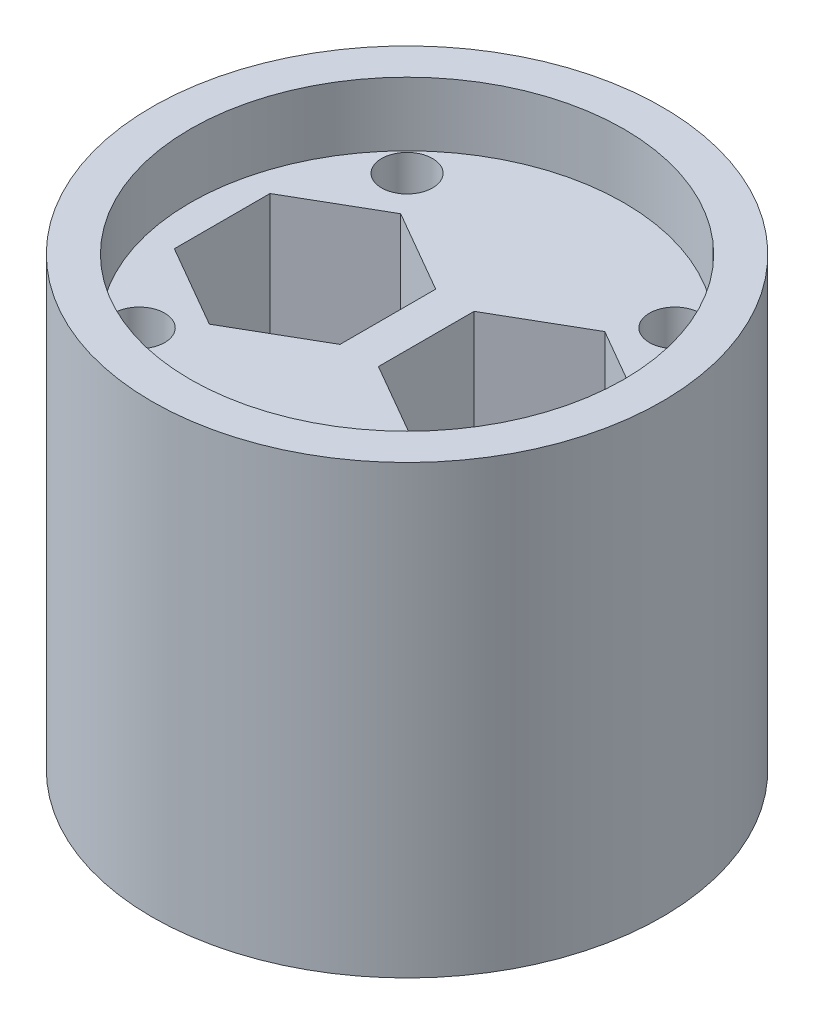
ISO-10303-21;
HEADER;
FILE_DESCRIPTION(('STEP AP214'),'2;1');
FILE_NAME('part.step','',(''),(''),'','','');
FILE_SCHEMA(('AUTOMOTIVE_DESIGN { 1 0 10303 214 1 1 1 1 }'));
ENDSEC;
DATA;
#1=APPLICATION_CONTEXT('core data for automotive mechanical design processes');
#2=APPLICATION_PROTOCOL_DEFINITION('international standard','automotive_design',2000,#1);
#3=PRODUCT_CONTEXT('',#1,'mechanical');
#4=PRODUCT('Part','Part','',(#3));
#5=PRODUCT_RELATED_PRODUCT_CATEGORY('part','',(#4));
#6=PRODUCT_DEFINITION_FORMATION('','',#4);
#7=PRODUCT_DEFINITION_CONTEXT('part definition',#1,'design');
#8=PRODUCT_DEFINITION('design','',#6,#7);
#9=PRODUCT_DEFINITION_SHAPE('','',#8);
#10=(LENGTH_UNIT() NAMED_UNIT(*) SI_UNIT(.MILLI.,.METRE.));
#11=(NAMED_UNIT(*) PLANE_ANGLE_UNIT() SI_UNIT($,.RADIAN.));
#12=(NAMED_UNIT(*) SI_UNIT($,.STERADIAN.) SOLID_ANGLE_UNIT());
#13=UNCERTAINTY_MEASURE_WITH_UNIT(LENGTH_MEASURE(1.E-05),#10,'distance_accuracy_value','');
#14=(GEOMETRIC_REPRESENTATION_CONTEXT(3) GLOBAL_UNCERTAINTY_ASSIGNED_CONTEXT((#13)) GLOBAL_UNIT_ASSIGNED_CONTEXT((#10,
#11,#12)) REPRESENTATION_CONTEXT('',''));
#15=CARTESIAN_POINT('',(0.,0.,0.));
#16=DIRECTION('',(0.,0.,1.));
#17=DIRECTION('',(1.,0.,0.));
#18=AXIS2_PLACEMENT_3D('',#15,#16,#17);
#19=CARTESIAN_POINT('',(-1.50480947161671,20.,-3.75));
#20=DIRECTION('',(0.5,0.,-0.866025403784439));
#21=DIRECTION('',(-0.866025403784439,0.,-0.5));
#22=AXIS2_PLACEMENT_3D('',#19,#20,#21);
#23=PLANE('',#22);
#24=DIRECTION('',(0.866025403784439,0.,0.5));
#25=VECTOR('',#24,1.);
#26=CARTESIAN_POINT('',(-1.50480947161671,30.,-3.75));
#27=LINE('',#26,#25);
#28=CARTESIAN_POINT('',(-8.,30.,-7.49999999999999));
#29=VERTEX_POINT('',#28);
#30=CARTESIAN_POINT('',(-1.50480947161671,30.,-3.75));
#31=VERTEX_POINT('',#30);
#32=EDGE_CURVE('E476',#29,#31,#27,.T.);
#33=ORIENTED_EDGE('',*,*,#32,.F.);
#34=DIRECTION('',(0.,1.,0.));
#35=VECTOR('',#34,1.);
#36=CARTESIAN_POINT('',(-8.,20.,-7.49999999999999));
#37=LINE('',#36,#35);
#38=CARTESIAN_POINT('',(-8.,20.,-7.49999999999999));
#39=VERTEX_POINT('',#38);
#40=EDGE_CURVE('E178',#39,#29,#37,.T.);
#41=ORIENTED_EDGE('',*,*,#40,.F.);
#42=DIRECTION('',(-0.866025403784439,0.,-0.5));
#43=VECTOR('',#42,1.);
#44=CARTESIAN_POINT('',(-1.50480947161671,20.,-3.75));
#45=LINE('',#44,#43);
#46=CARTESIAN_POINT('',(-1.50480947161671,20.,-3.75));
#47=VERTEX_POINT('',#46);
#48=EDGE_CURVE('E160',#47,#39,#45,.T.);
#49=ORIENTED_EDGE('',*,*,#48,.F.);
#50=DIRECTION('',(0.,1.,0.));
#51=VECTOR('',#50,1.);
#52=CARTESIAN_POINT('',(-1.50480947161671,20.,-3.75));
#53=LINE('',#52,#51);
#54=EDGE_CURVE('E179',#47,#31,#53,.T.);
#55=ORIENTED_EDGE('',*,*,#54,.T.);
#56=EDGE_LOOP('',(#33,#41,#49,#55));
#57=FACE_BOUND('',#56,.T.);
#58=ADVANCED_FACE('F37',(#57),#23,.F.);
#59=CARTESIAN_POINT('',(-1.50480947161671,20.,3.75));
#60=DIRECTION('',(1.,0.,0.));
#61=DIRECTION('',(0.,0.,-1.));
#62=AXIS2_PLACEMENT_3D('',#59,#60,#61);
#63=PLANE('',#62);
#64=DIRECTION('',(0.,0.,1.));
#65=VECTOR('',#64,1.);
#66=CARTESIAN_POINT('',(-1.50480947161671,30.,3.75));
#67=LINE('',#66,#65);
#68=CARTESIAN_POINT('',(-1.50480947161671,30.,3.75));
#69=VERTEX_POINT('',#68);
#70=EDGE_CURVE('E474',#31,#69,#67,.T.);
#71=ORIENTED_EDGE('',*,*,#70,.F.);
#72=ORIENTED_EDGE('',*,*,#54,.F.);
#73=DIRECTION('',(0.,0.,-1.));
#74=VECTOR('',#73,1.);
#75=CARTESIAN_POINT('',(-1.50480947161671,20.,3.75));
#76=LINE('',#75,#74);
#77=CARTESIAN_POINT('',(-1.50480947161671,20.,3.75));
#78=VERTEX_POINT('',#77);
#79=EDGE_CURVE('E175',#78,#47,#76,.T.);
#80=ORIENTED_EDGE('',*,*,#79,.F.);
#81=DIRECTION('',(0.,1.,0.));
#82=VECTOR('',#81,1.);
#83=CARTESIAN_POINT('',(-1.50480947161671,20.,3.75));
#84=LINE('',#83,#82);
#85=EDGE_CURVE('E182',#78,#69,#84,.T.);
#86=ORIENTED_EDGE('',*,*,#85,.T.);
#87=EDGE_LOOP('',(#71,#72,#80,#86));
#88=FACE_BOUND('',#87,.T.);
#89=ADVANCED_FACE('F216',(#88),#63,.F.);
#90=CARTESIAN_POINT('',(-8.,20.,7.5));
#91=DIRECTION('',(0.5,0.,0.866025403784439));
#92=DIRECTION('',(0.866025403784439,0.,-0.5));
#93=AXIS2_PLACEMENT_3D('',#90,#91,#92);
#94=PLANE('',#93);
#95=DIRECTION('',(-0.866025403784439,0.,0.5));
#96=VECTOR('',#95,1.);
#97=CARTESIAN_POINT('',(-8.,30.,7.5));
#98=LINE('',#97,#96);
#99=CARTESIAN_POINT('',(-8.,30.,7.5));
#100=VERTEX_POINT('',#99);
#101=EDGE_CURVE('E472',#69,#100,#98,.T.);
#102=ORIENTED_EDGE('',*,*,#101,.F.);
#103=ORIENTED_EDGE('',*,*,#85,.F.);
#104=DIRECTION('',(0.866025403784439,0.,-0.5));
#105=VECTOR('',#104,1.);
#106=CARTESIAN_POINT('',(-8.,20.,7.5));
#107=LINE('',#106,#105);
#108=CARTESIAN_POINT('',(-8.,20.,7.5));
#109=VERTEX_POINT('',#108);
#110=EDGE_CURVE('E172',#109,#78,#107,.T.);
#111=ORIENTED_EDGE('',*,*,#110,.F.);
#112=DIRECTION('',(0.,1.,0.));
#113=VECTOR('',#112,1.);
#114=CARTESIAN_POINT('',(-8.,20.,7.5));
#115=LINE('',#114,#113);
#116=EDGE_CURVE('E185',#109,#100,#115,.T.);
#117=ORIENTED_EDGE('',*,*,#116,.T.);
#118=EDGE_LOOP('',(#102,#103,#111,#117));
#119=FACE_BOUND('',#118,.T.);
#120=ADVANCED_FACE('F222',(#119),#94,.F.);
#121=CARTESIAN_POINT('',(-14.4951905283833,20.,3.75));
#122=DIRECTION('',(-0.5,0.,0.866025403784439));
#123=DIRECTION('',(0.866025403784439,0.,0.5));
#124=AXIS2_PLACEMENT_3D('',#121,#122,#123);
#125=PLANE('',#124);
#126=DIRECTION('',(-0.866025403784439,0.,-0.5));
#127=VECTOR('',#126,1.);
#128=CARTESIAN_POINT('',(-14.4951905283833,30.,3.75));
#129=LINE('',#128,#127);
#130=CARTESIAN_POINT('',(-14.4951905283833,30.,3.75));
#131=VERTEX_POINT('',#130);
#132=EDGE_CURVE('E470',#100,#131,#129,.T.);
#133=ORIENTED_EDGE('',*,*,#132,.F.);
#134=ORIENTED_EDGE('',*,*,#116,.F.);
#135=DIRECTION('',(0.866025403784439,0.,0.5));
#136=VECTOR('',#135,1.);
#137=CARTESIAN_POINT('',(-14.4951905283833,20.,3.75));
#138=LINE('',#137,#136);
#139=CARTESIAN_POINT('',(-14.4951905283833,20.,3.75));
#140=VERTEX_POINT('',#139);
#141=EDGE_CURVE('E169',#140,#109,#138,.T.);
#142=ORIENTED_EDGE('',*,*,#141,.F.);
#143=DIRECTION('',(0.,1.,0.));
#144=VECTOR('',#143,1.);
#145=CARTESIAN_POINT('',(-14.4951905283833,20.,3.75));
#146=LINE('',#145,#144);
#147=EDGE_CURVE('E188',#140,#131,#146,.T.);
#148=ORIENTED_EDGE('',*,*,#147,.T.);
#149=EDGE_LOOP('',(#133,#134,#142,#148));
#150=FACE_BOUND('',#149,.T.);
#151=ADVANCED_FACE('F234',(#150),#125,.F.);
#152=CARTESIAN_POINT('',(-14.4951905283833,20.,-3.75));
#153=DIRECTION('',(-1.,0.,0.));
#154=DIRECTION('',(0.,0.,1.));
#155=AXIS2_PLACEMENT_3D('',#152,#153,#154);
#156=PLANE('',#155);
#157=DIRECTION('',(0.,0.,-1.));
#158=VECTOR('',#157,1.);
#159=CARTESIAN_POINT('',(-14.4951905283833,30.,-3.75));
#160=LINE('',#159,#158);
#161=CARTESIAN_POINT('',(-14.4951905283833,30.,-3.75));
#162=VERTEX_POINT('',#161);
#163=EDGE_CURVE('E54',#131,#162,#160,.T.);
#164=ORIENTED_EDGE('',*,*,#163,.F.);
#165=ORIENTED_EDGE('',*,*,#147,.F.);
#166=DIRECTION('',(0.,0.,1.));
#167=VECTOR('',#166,1.);
#168=CARTESIAN_POINT('',(-14.4951905283833,20.,-3.75));
#169=LINE('',#168,#167);
#170=CARTESIAN_POINT('',(-14.4951905283833,20.,-3.75));
#171=VERTEX_POINT('',#170);
#172=EDGE_CURVE('E166',#171,#140,#169,.T.);
#173=ORIENTED_EDGE('',*,*,#172,.F.);
#174=DIRECTION('',(0.,1.,0.));
#175=VECTOR('',#174,1.);
#176=CARTESIAN_POINT('',(-14.4951905283833,20.,-3.75));
#177=LINE('',#176,#175);
#178=EDGE_CURVE('E191',#171,#162,#177,.T.);
#179=ORIENTED_EDGE('',*,*,#178,.T.);
#180=EDGE_LOOP('',(#164,#165,#173,#179));
#181=FACE_BOUND('',#180,.T.);
#182=ADVANCED_FACE('F230',(#181),#156,.F.);
#183=CARTESIAN_POINT('',(-8.,20.,-7.49999999999999));
#184=DIRECTION('',(-0.5,0.,-0.866025403784439));
#185=DIRECTION('',(-0.866025403784439,0.,0.5));
#186=AXIS2_PLACEMENT_3D('',#183,#184,#185);
#187=PLANE('',#186);
#188=DIRECTION('',(0.866025403784439,0.,-0.5));
#189=VECTOR('',#188,1.);
#190=CARTESIAN_POINT('',(-8.,30.,-7.49999999999999));
#191=LINE('',#190,#189);
#192=EDGE_CURVE('E143',#162,#29,#191,.T.);
#193=ORIENTED_EDGE('',*,*,#192,.F.);
#194=ORIENTED_EDGE('',*,*,#178,.F.);
#195=DIRECTION('',(-0.866025403784439,0.,0.5));
#196=VECTOR('',#195,1.);
#197=CARTESIAN_POINT('',(-8.,20.,-7.49999999999999));
#198=LINE('',#197,#196);
#199=EDGE_CURVE('E163',#39,#171,#198,.T.);
#200=ORIENTED_EDGE('',*,*,#199,.F.);
#201=ORIENTED_EDGE('',*,*,#40,.T.);
#202=EDGE_LOOP('',(#193,#194,#200,#201));
#203=FACE_BOUND('',#202,.T.);
#204=ADVANCED_FACE('F227',(#203),#187,.F.);
#205=CARTESIAN_POINT('',(14.4951905283833,20.,-3.75000000000001));
#206=DIRECTION('',(0.499999999999999,0.,-0.866025403784439));
#207=DIRECTION('',(-0.866025403784439,0.,-0.499999999999999));
#208=AXIS2_PLACEMENT_3D('',#205,#206,#207);
#209=PLANE('',#208);
#210=DIRECTION('',(0.866025403784439,0.,0.499999999999999));
#211=VECTOR('',#210,1.);
#212=CARTESIAN_POINT('',(14.4951905283833,30.,-3.75000000000001));
#213=LINE('',#212,#211);
#214=CARTESIAN_POINT('',(8.,30.,-7.5));
#215=VERTEX_POINT('',#214);
#216=CARTESIAN_POINT('',(14.4951905283833,30.,-3.75000000000001));
#217=VERTEX_POINT('',#216);
#218=EDGE_CURVE('E129',#215,#217,#213,.T.);
#219=ORIENTED_EDGE('',*,*,#218,.F.);
#220=DIRECTION('',(0.,1.,0.));
#221=VECTOR('',#220,1.);
#222=CARTESIAN_POINT('',(8.,20.,-7.5));
#223=LINE('',#222,#221);
#224=CARTESIAN_POINT('',(8.,20.,-7.5));
#225=VERTEX_POINT('',#224);
#226=EDGE_CURVE('E140',#225,#215,#223,.T.);
#227=ORIENTED_EDGE('',*,*,#226,.F.);
#228=DIRECTION('',(-0.866025403784439,0.,-0.499999999999999));
#229=VECTOR('',#228,1.);
#230=CARTESIAN_POINT('',(14.4951905283833,20.,-3.75000000000001));
#231=LINE('',#230,#229);
#232=CARTESIAN_POINT('',(14.4951905283833,20.,-3.75000000000001));
#233=VERTEX_POINT('',#232);
#234=EDGE_CURVE('E499',#233,#225,#231,.T.);
#235=ORIENTED_EDGE('',*,*,#234,.F.);
#236=DIRECTION('',(0.,1.,0.));
#237=VECTOR('',#236,1.);
#238=CARTESIAN_POINT('',(14.4951905283833,20.,-3.75000000000001));
#239=LINE('',#238,#237);
#240=EDGE_CURVE('E142',#233,#217,#239,.T.);
#241=ORIENTED_EDGE('',*,*,#240,.T.);
#242=EDGE_LOOP('',(#219,#227,#235,#241));
#243=FACE_BOUND('',#242,.T.);
#244=ADVANCED_FACE('F138',(#243),#209,.F.);
#245=CARTESIAN_POINT('',(14.4951905283833,20.,3.75));
#246=DIRECTION('',(1.,0.,0.));
#247=DIRECTION('',(0.,0.,-1.));
#248=AXIS2_PLACEMENT_3D('',#245,#246,#247);
#249=PLANE('',#248);
#250=DIRECTION('',(0.,0.,1.));
#251=VECTOR('',#250,1.);
#252=CARTESIAN_POINT('',(14.4951905283833,30.,3.75));
#253=LINE('',#252,#251);
#254=CARTESIAN_POINT('',(14.4951905283833,30.,3.75));
#255=VERTEX_POINT('',#254);
#256=EDGE_CURVE('E144',#217,#255,#253,.T.);
#257=ORIENTED_EDGE('',*,*,#256,.F.);
#258=ORIENTED_EDGE('',*,*,#240,.F.);
#259=DIRECTION('',(0.,0.,-1.));
#260=VECTOR('',#259,1.);
#261=CARTESIAN_POINT('',(14.4951905283833,20.,3.75));
#262=LINE('',#261,#260);
#263=CARTESIAN_POINT('',(14.4951905283833,20.,3.75));
#264=VERTEX_POINT('',#263);
#265=EDGE_CURVE('E151',#264,#233,#262,.T.);
#266=ORIENTED_EDGE('',*,*,#265,.F.);
#267=DIRECTION('',(0.,1.,0.));
#268=VECTOR('',#267,1.);
#269=CARTESIAN_POINT('',(14.4951905283833,20.,3.75));
#270=LINE('',#269,#268);
#271=EDGE_CURVE('E513',#264,#255,#270,.T.);
#272=ORIENTED_EDGE('',*,*,#271,.T.);
#273=EDGE_LOOP('',(#257,#258,#266,#272));
#274=FACE_BOUND('',#273,.T.);
#275=ADVANCED_FACE('F244',(#274),#249,.F.);
#276=CARTESIAN_POINT('',(8.00000000000001,20.,7.5));
#277=DIRECTION('',(0.5,0.,0.866025403784438));
#278=DIRECTION('',(0.866025403784439,0.,-0.5));
#279=AXIS2_PLACEMENT_3D('',#276,#277,#278);
#280=PLANE('',#279);
#281=DIRECTION('',(-0.866025403784439,0.,0.5));
#282=VECTOR('',#281,1.);
#283=CARTESIAN_POINT('',(8.00000000000001,30.,7.5));
#284=LINE('',#283,#282);
#285=CARTESIAN_POINT('',(8.00000000000001,30.,7.5));
#286=VERTEX_POINT('',#285);
#287=EDGE_CURVE('E465',#255,#286,#284,.T.);
#288=ORIENTED_EDGE('',*,*,#287,.F.);
#289=ORIENTED_EDGE('',*,*,#271,.F.);
#290=DIRECTION('',(0.866025403784438,0.,-0.5));
#291=VECTOR('',#290,1.);
#292=CARTESIAN_POINT('',(8.00000000000001,20.,7.5));
#293=LINE('',#292,#291);
#294=CARTESIAN_POINT('',(8.00000000000001,20.,7.5));
#295=VERTEX_POINT('',#294);
#296=EDGE_CURVE('E156',#295,#264,#293,.T.);
#297=ORIENTED_EDGE('',*,*,#296,.F.);
#298=DIRECTION('',(0.,1.,0.));
#299=VECTOR('',#298,1.);
#300=CARTESIAN_POINT('',(8.00000000000001,20.,7.5));
#301=LINE('',#300,#299);
#302=EDGE_CURVE('E516',#295,#286,#301,.T.);
#303=ORIENTED_EDGE('',*,*,#302,.T.);
#304=EDGE_LOOP('',(#288,#289,#297,#303));
#305=FACE_BOUND('',#304,.T.);
#306=ADVANCED_FACE('F255',(#305),#280,.F.);
#307=CARTESIAN_POINT('',(1.50480947161672,20.,3.75));
#308=DIRECTION('',(-0.5,0.,0.866025403784439));
#309=DIRECTION('',(0.866025403784439,0.,0.5));
#310=AXIS2_PLACEMENT_3D('',#307,#308,#309);
#311=PLANE('',#310);
#312=DIRECTION('',(-0.866025403784439,0.,-0.5));
#313=VECTOR('',#312,1.);
#314=CARTESIAN_POINT('',(1.50480947161672,30.,3.75));
#315=LINE('',#314,#313);
#316=CARTESIAN_POINT('',(1.50480947161672,30.,3.75));
#317=VERTEX_POINT('',#316);
#318=EDGE_CURVE('E463',#286,#317,#315,.T.);
#319=ORIENTED_EDGE('',*,*,#318,.F.);
#320=ORIENTED_EDGE('',*,*,#302,.F.);
#321=DIRECTION('',(0.866025403784439,0.,0.5));
#322=VECTOR('',#321,1.);
#323=CARTESIAN_POINT('',(1.50480947161672,20.,3.75));
#324=LINE('',#323,#322);
#325=CARTESIAN_POINT('',(1.50480947161672,20.,3.75));
#326=VERTEX_POINT('',#325);
#327=EDGE_CURVE('E507',#326,#295,#324,.T.);
#328=ORIENTED_EDGE('',*,*,#327,.F.);
#329=DIRECTION('',(0.,1.,0.));
#330=VECTOR('',#329,1.);
#331=CARTESIAN_POINT('',(1.50480947161672,20.,3.75));
#332=LINE('',#331,#330);
#333=EDGE_CURVE('E153',#326,#317,#332,.T.);
#334=ORIENTED_EDGE('',*,*,#333,.T.);
#335=EDGE_LOOP('',(#319,#320,#328,#334));
#336=FACE_BOUND('',#335,.T.);
#337=ADVANCED_FACE('F251',(#336),#311,.F.);
#338=CARTESIAN_POINT('',(1.50480947161671,20.,-3.75));
#339=DIRECTION('',(-1.,0.,0.));
#340=DIRECTION('',(0.,0.,1.));
#341=AXIS2_PLACEMENT_3D('',#338,#339,#340);
#342=PLANE('',#341);
#343=DIRECTION('',(0.,0.,-1.));
#344=VECTOR('',#343,1.);
#345=CARTESIAN_POINT('',(1.50480947161671,30.,-3.75));
#346=LINE('',#345,#344);
#347=CARTESIAN_POINT('',(1.50480947161671,30.,-3.75));
#348=VERTEX_POINT('',#347);
#349=EDGE_CURVE('E62',#317,#348,#346,.T.);
#350=ORIENTED_EDGE('',*,*,#349,.F.);
#351=ORIENTED_EDGE('',*,*,#333,.F.);
#352=DIRECTION('',(0.,0.,1.));
#353=VECTOR('',#352,1.);
#354=CARTESIAN_POINT('',(1.50480947161671,20.,-3.75));
#355=LINE('',#354,#353);
#356=CARTESIAN_POINT('',(1.50480947161671,20.,-3.75));
#357=VERTEX_POINT('',#356);
#358=EDGE_CURVE('E504',#357,#326,#355,.T.);
#359=ORIENTED_EDGE('',*,*,#358,.F.);
#360=DIRECTION('',(0.,1.,0.));
#361=VECTOR('',#360,1.);
#362=CARTESIAN_POINT('',(1.50480947161671,20.,-3.75));
#363=LINE('',#362,#361);
#364=EDGE_CURVE('E150',#357,#348,#363,.T.);
#365=ORIENTED_EDGE('',*,*,#364,.T.);
#366=EDGE_LOOP('',(#350,#351,#359,#365));
#367=FACE_BOUND('',#366,.T.);
#368=ADVANCED_FACE('F248',(#367),#342,.F.);
#369=CARTESIAN_POINT('',(8.,20.,-7.5));
#370=DIRECTION('',(-0.5,0.,-0.866025403784438));
#371=DIRECTION('',(-0.866025403784438,0.,0.5));
#372=AXIS2_PLACEMENT_3D('',#369,#370,#371);
#373=PLANE('',#372);
#374=DIRECTION('',(0.866025403784438,0.,-0.5));
#375=VECTOR('',#374,1.);
#376=CARTESIAN_POINT('',(8.,30.,-7.5));
#377=LINE('',#376,#375);
#378=EDGE_CURVE('E125',#348,#215,#377,.T.);
#379=ORIENTED_EDGE('',*,*,#378,.F.);
#380=ORIENTED_EDGE('',*,*,#364,.F.);
#381=DIRECTION('',(-0.866025403784438,0.,0.5));
#382=VECTOR('',#381,1.);
#383=CARTESIAN_POINT('',(8.,20.,-7.5));
#384=LINE('',#383,#382);
#385=EDGE_CURVE('E148',#225,#357,#384,.T.);
#386=ORIENTED_EDGE('',*,*,#385,.F.);
#387=ORIENTED_EDGE('',*,*,#226,.T.);
#388=EDGE_LOOP('',(#379,#380,#386,#387));
#389=FACE_BOUND('',#388,.T.);
#390=ADVANCED_FACE('F146',(#389),#373,.F.);
#391=CARTESIAN_POINT('',(-10.5,0.,-10.5));
#392=DIRECTION('',(0.,1.,0.));
#393=DIRECTION('',(0.,0.,1.));
#394=AXIS2_PLACEMENT_3D('',#391,#392,#393);
#395=CYLINDRICAL_SURFACE('',#394,2.);
#396=CARTESIAN_POINT('',(-10.5,0.,-10.5));
#397=DIRECTION('',(0.,1.,0.));
#398=DIRECTION('',(0.,0.,1.));
#399=AXIS2_PLACEMENT_3D('',#396,#397,#398);
#400=CIRCLE('',#399,2.);
#401=CARTESIAN_POINT('',(-10.5,0.,-8.5));
#402=VERTEX_POINT('',#401);
#403=EDGE_CURVE('E481',#402,#402,#400,.T.);
#404=ORIENTED_EDGE('',*,*,#403,.F.);
#405=EDGE_LOOP('',(#404));
#406=FACE_BOUND('',#405,.T.);
#407=CARTESIAN_POINT('',(-10.5,30.,-10.5));
#408=DIRECTION('',(0.,1.,0.));
#409=DIRECTION('',(0.,0.,1.));
#410=AXIS2_PLACEMENT_3D('',#407,#408,#409);
#411=CIRCLE('',#410,2.);
#412=CARTESIAN_POINT('',(-10.5,30.,-8.5));
#413=VERTEX_POINT('',#412);
#414=EDGE_CURVE('E134',#413,#413,#411,.F.);
#415=ORIENTED_EDGE('',*,*,#414,.F.);
#416=EDGE_LOOP('',(#415));
#417=FACE_BOUND('',#416,.T.);
#418=ADVANCED_FACE('F247',(#406,#417),#395,.F.);
#419=CARTESIAN_POINT('',(-10.5,0.,10.5));
#420=DIRECTION('',(0.,1.,0.));
#421=DIRECTION('',(0.,0.,1.));
#422=AXIS2_PLACEMENT_3D('',#419,#420,#421);
#423=CYLINDRICAL_SURFACE('',#422,2.);
#424=CARTESIAN_POINT('',(-10.5,0.,10.5));
#425=DIRECTION('',(0.,1.,0.));
#426=DIRECTION('',(0.,0.,1.));
#427=AXIS2_PLACEMENT_3D('',#424,#425,#426);
#428=CIRCLE('',#427,2.);
#429=CARTESIAN_POINT('',(-10.5,0.,12.5));
#430=VERTEX_POINT('',#429);
#431=EDGE_CURVE('E478',#430,#430,#428,.T.);
#432=ORIENTED_EDGE('',*,*,#431,.F.);
#433=EDGE_LOOP('',(#432));
#434=FACE_BOUND('',#433,.T.);
#435=CARTESIAN_POINT('',(-10.5,30.,10.5));
#436=DIRECTION('',(0.,1.,0.));
#437=DIRECTION('',(0.,0.,1.));
#438=AXIS2_PLACEMENT_3D('',#435,#436,#437);
#439=CIRCLE('',#438,2.);
#440=CARTESIAN_POINT('',(-10.5,30.,12.5));
#441=VERTEX_POINT('',#440);
#442=EDGE_CURVE('E457',#441,#441,#439,.F.);
#443=ORIENTED_EDGE('',*,*,#442,.F.);
#444=EDGE_LOOP('',(#443));
#445=FACE_BOUND('',#444,.T.);
#446=ADVANCED_FACE('F276',(#434,#445),#423,.F.);
#447=CARTESIAN_POINT('',(10.5,0.,10.5));
#448=DIRECTION('',(0.,1.,0.));
#449=DIRECTION('',(0.,0.,1.));
#450=AXIS2_PLACEMENT_3D('',#447,#448,#449);
#451=CYLINDRICAL_SURFACE('',#450,2.);
#452=CARTESIAN_POINT('',(10.5,0.,10.5));
#453=DIRECTION('',(0.,1.,0.));
#454=DIRECTION('',(0.,0.,1.));
#455=AXIS2_PLACEMENT_3D('',#452,#453,#454);
#456=CIRCLE('',#455,2.);
#457=CARTESIAN_POINT('',(10.5,0.,12.5));
#458=VERTEX_POINT('',#457);
#459=EDGE_CURVE('E482',#458,#458,#456,.T.);
#460=ORIENTED_EDGE('',*,*,#459,.F.);
#461=EDGE_LOOP('',(#460));
#462=FACE_BOUND('',#461,.T.);
#463=CARTESIAN_POINT('',(10.5,30.,10.5));
#464=DIRECTION('',(0.,1.,0.));
#465=DIRECTION('',(0.,0.,1.));
#466=AXIS2_PLACEMENT_3D('',#463,#464,#465);
#467=CIRCLE('',#466,2.);
#468=CARTESIAN_POINT('',(10.5,30.,12.5));
#469=VERTEX_POINT('',#468);
#470=EDGE_CURVE('E454',#469,#469,#467,.F.);
#471=ORIENTED_EDGE('',*,*,#470,.F.);
#472=EDGE_LOOP('',(#471));
#473=FACE_BOUND('',#472,.T.);
#474=ADVANCED_FACE('F280',(#462,#473),#451,.F.);
#475=CARTESIAN_POINT('',(10.5,0.,-10.5));
#476=DIRECTION('',(0.,1.,0.));
#477=DIRECTION('',(0.,0.,1.));
#478=AXIS2_PLACEMENT_3D('',#475,#476,#477);
#479=CYLINDRICAL_SURFACE('',#478,2.);
#480=CARTESIAN_POINT('',(10.5,0.,-10.5));
#481=DIRECTION('',(0.,1.,0.));
#482=DIRECTION('',(0.,0.,1.));
#483=AXIS2_PLACEMENT_3D('',#480,#481,#482);
#484=CIRCLE('',#483,2.);
#485=CARTESIAN_POINT('',(10.5,0.,-8.5));
#486=VERTEX_POINT('',#485);
#487=EDGE_CURVE('E479',#486,#486,#484,.T.);
#488=ORIENTED_EDGE('',*,*,#487,.F.);
#489=EDGE_LOOP('',(#488));
#490=FACE_BOUND('',#489,.T.);
#491=CARTESIAN_POINT('',(10.5,30.,-10.5));
#492=DIRECTION('',(0.,1.,0.));
#493=DIRECTION('',(0.,0.,1.));
#494=AXIS2_PLACEMENT_3D('',#491,#492,#493);
#495=CIRCLE('',#494,2.);
#496=CARTESIAN_POINT('',(10.5,30.,-8.5));
#497=VERTEX_POINT('',#496);
#498=EDGE_CURVE('E41',#497,#497,#495,.F.);
#499=ORIENTED_EDGE('',*,*,#498,.F.);
#500=EDGE_LOOP('',(#499));
#501=FACE_BOUND('',#500,.T.);
#502=ADVANCED_FACE('F284',(#490,#501),#479,.F.);
#503=CARTESIAN_POINT('',(0.,35.,0.));
#504=DIRECTION('',(0.,-1.,0.));
#505=DIRECTION('',(0.,0.,-1.));
#506=AXIS2_PLACEMENT_3D('',#503,#504,#505);
#507=CYLINDRICAL_SURFACE('',#506,20.);
#508=CARTESIAN_POINT('',(0.,35.,0.));
#509=DIRECTION('',(0.,1.,0.));
#510=DIRECTION('',(0.,0.,1.));
#511=AXIS2_PLACEMENT_3D('',#508,#509,#510);
#512=CIRCLE('',#511,20.);
#513=CARTESIAN_POINT('',(0.,35.,20.));
#514=VERTEX_POINT('',#513);
#515=EDGE_CURVE('E11',#514,#514,#512,.T.);
#516=ORIENTED_EDGE('',*,*,#515,.F.);
#517=EDGE_LOOP('',(#516));
#518=FACE_BOUND('',#517,.T.);
#519=CARTESIAN_POINT('',(0.,0.,0.));
#520=DIRECTION('',(0.,1.,0.));
#521=DIRECTION('',(0.,0.,1.));
#522=AXIS2_PLACEMENT_3D('',#519,#520,#521);
#523=CIRCLE('',#522,20.);
#524=CARTESIAN_POINT('',(0.,0.,20.));
#525=VERTEX_POINT('',#524);
#526=EDGE_CURVE('E46',#525,#525,#523,.T.);
#527=ORIENTED_EDGE('',*,*,#526,.T.);
#528=EDGE_LOOP('',(#527));
#529=FACE_BOUND('',#528,.T.);
#530=ADVANCED_FACE('F39',(#518,#529),#507,.T.);
#531=CARTESIAN_POINT('',(0.,35.,0.));
#532=DIRECTION('',(0.,1.,0.));
#533=DIRECTION('',(0.,0.,1.));
#534=AXIS2_PLACEMENT_3D('',#531,#532,#533);
#535=PLANE('',#534);
#536=CARTESIAN_POINT('',(0.,35.,0.));
#537=DIRECTION('',(0.,1.,0.));
#538=DIRECTION('',(0.,0.,1.));
#539=AXIS2_PLACEMENT_3D('',#536,#537,#538);
#540=CIRCLE('',#539,17.);
#541=CARTESIAN_POINT('',(0.,35.,17.));
#542=VERTEX_POINT('',#541);
#543=EDGE_CURVE('E450',#542,#542,#540,.T.);
#544=ORIENTED_EDGE('',*,*,#543,.F.);
#545=EDGE_LOOP('',(#544));
#546=FACE_BOUND('',#545,.T.);
#547=ORIENTED_EDGE('',*,*,#515,.T.);
#548=EDGE_LOOP('',(#547));
#549=FACE_BOUND('',#548,.T.);
#550=ADVANCED_FACE('F202',(#546,#549),#535,.T.);
#551=CARTESIAN_POINT('',(0.,0.,0.));
#552=DIRECTION('',(0.,1.,0.));
#553=DIRECTION('',(0.,0.,1.));
#554=AXIS2_PLACEMENT_3D('',#551,#552,#553);
#555=PLANE('',#554);
#556=ORIENTED_EDGE('',*,*,#487,.T.);
#557=EDGE_LOOP('',(#556));
#558=FACE_BOUND('',#557,.T.);
#559=ORIENTED_EDGE('',*,*,#459,.T.);
#560=EDGE_LOOP('',(#559));
#561=FACE_BOUND('',#560,.T.);
#562=ORIENTED_EDGE('',*,*,#431,.T.);
#563=EDGE_LOOP('',(#562));
#564=FACE_BOUND('',#563,.T.);
#565=ORIENTED_EDGE('',*,*,#403,.T.);
#566=EDGE_LOOP('',(#565));
#567=FACE_BOUND('',#566,.T.);
#568=CARTESIAN_POINT('',(8.,0.,0.));
#569=DIRECTION('',(0.,1.,0.));
#570=DIRECTION('',(0.,0.,1.));
#571=AXIS2_PLACEMENT_3D('',#568,#569,#570);
#572=CIRCLE('',#571,4.1);
#573=CARTESIAN_POINT('',(8.,0.,4.1));
#574=VERTEX_POINT('',#573);
#575=EDGE_CURVE('E490',#574,#574,#572,.T.);
#576=ORIENTED_EDGE('',*,*,#575,.T.);
#577=EDGE_LOOP('',(#576));
#578=FACE_BOUND('',#577,.T.);
#579=CARTESIAN_POINT('',(-7.99999999999999,0.,0.));
#580=DIRECTION('',(0.,1.,0.));
#581=DIRECTION('',(0.,0.,1.));
#582=AXIS2_PLACEMENT_3D('',#579,#580,#581);
#583=CIRCLE('',#582,4.1);
#584=CARTESIAN_POINT('',(-7.99999999999999,0.,4.1));
#585=VERTEX_POINT('',#584);
#586=EDGE_CURVE('E496',#585,#585,#583,.T.);
#587=ORIENTED_EDGE('',*,*,#586,.T.);
#588=EDGE_LOOP('',(#587));
#589=FACE_BOUND('',#588,.T.);
#590=ORIENTED_EDGE('',*,*,#526,.F.);
#591=EDGE_LOOP('',(#590));
#592=FACE_BOUND('',#591,.T.);
#593=ADVANCED_FACE('F199',(#558,#561,#564,#567,#578,#589,#592),#555,.F.);
#594=CARTESIAN_POINT('',(0.,20.,0.));
#595=DIRECTION('',(0.,1.,0.));
#596=DIRECTION('',(0.,0.,1.));
#597=AXIS2_PLACEMENT_3D('',#594,#595,#596);
#598=PLANE('',#597);
#599=CARTESIAN_POINT('',(-7.99999999999999,20.,0.));
#600=DIRECTION('',(0.,1.,0.));
#601=DIRECTION('',(0.,0.,1.));
#602=AXIS2_PLACEMENT_3D('',#599,#600,#601);
#603=CIRCLE('',#602,4.1);
#604=CARTESIAN_POINT('',(-7.99999999999999,20.,4.1));
#605=VERTEX_POINT('',#604);
#606=EDGE_CURVE('E493',#605,#605,#603,.T.);
#607=ORIENTED_EDGE('',*,*,#606,.F.);
#608=EDGE_LOOP('',(#607));
#609=FACE_BOUND('',#608,.T.);
#610=ORIENTED_EDGE('',*,*,#48,.T.);
#611=ORIENTED_EDGE('',*,*,#199,.T.);
#612=ORIENTED_EDGE('',*,*,#172,.T.);
#613=ORIENTED_EDGE('',*,*,#141,.T.);
#614=ORIENTED_EDGE('',*,*,#110,.T.);
#615=ORIENTED_EDGE('',*,*,#79,.T.);
#616=EDGE_LOOP('',(#610,#611,#612,#613,#614,#615));
#617=FACE_BOUND('',#616,.T.);
#618=ADVANCED_FACE('F201',(#609,#617),#598,.T.);
#619=CARTESIAN_POINT('',(0.,20.,0.));
#620=DIRECTION('',(0.,1.,0.));
#621=DIRECTION('',(0.,0.,1.));
#622=AXIS2_PLACEMENT_3D('',#619,#620,#621);
#623=PLANE('',#622);
#624=CARTESIAN_POINT('',(8.,20.,0.));
#625=DIRECTION('',(0.,1.,0.));
#626=DIRECTION('',(0.,0.,1.));
#627=AXIS2_PLACEMENT_3D('',#624,#625,#626);
#628=CIRCLE('',#627,4.1);
#629=CARTESIAN_POINT('',(8.,20.,4.1));
#630=VERTEX_POINT('',#629);
#631=EDGE_CURVE('E489',#630,#630,#628,.T.);
#632=ORIENTED_EDGE('',*,*,#631,.F.);
#633=EDGE_LOOP('',(#632));
#634=FACE_BOUND('',#633,.T.);
#635=ORIENTED_EDGE('',*,*,#234,.T.);
#636=ORIENTED_EDGE('',*,*,#385,.T.);
#637=ORIENTED_EDGE('',*,*,#358,.T.);
#638=ORIENTED_EDGE('',*,*,#327,.T.);
#639=ORIENTED_EDGE('',*,*,#296,.T.);
#640=ORIENTED_EDGE('',*,*,#265,.T.);
#641=EDGE_LOOP('',(#635,#636,#637,#638,#639,#640));
#642=FACE_BOUND('',#641,.T.);
#643=ADVANCED_FACE('F208',(#634,#642),#623,.T.);
#644=CARTESIAN_POINT('',(-7.99999999999999,0.,0.));
#645=DIRECTION('',(0.,1.,0.));
#646=DIRECTION('',(0.,0.,1.));
#647=AXIS2_PLACEMENT_3D('',#644,#645,#646);
#648=CYLINDRICAL_SURFACE('',#647,4.1);
#649=ORIENTED_EDGE('',*,*,#586,.F.);
#650=EDGE_LOOP('',(#649));
#651=FACE_BOUND('',#650,.T.);
#652=ORIENTED_EDGE('',*,*,#606,.T.);
#653=EDGE_LOOP('',(#652));
#654=FACE_BOUND('',#653,.T.);
#655=ADVANCED_FACE('F265',(#651,#654),#648,.F.);
#656=CARTESIAN_POINT('',(8.,0.,0.));
#657=DIRECTION('',(0.,1.,0.));
#658=DIRECTION('',(0.,0.,1.));
#659=AXIS2_PLACEMENT_3D('',#656,#657,#658);
#660=CYLINDRICAL_SURFACE('',#659,4.1);
#661=ORIENTED_EDGE('',*,*,#575,.F.);
#662=EDGE_LOOP('',(#661));
#663=FACE_BOUND('',#662,.T.);
#664=ORIENTED_EDGE('',*,*,#631,.T.);
#665=EDGE_LOOP('',(#664));
#666=FACE_BOUND('',#665,.T.);
#667=ADVANCED_FACE('F269',(#663,#666),#660,.F.);
#668=CARTESIAN_POINT('',(0.,30.,0.));
#669=DIRECTION('',(0.,1.,0.));
#670=DIRECTION('',(0.,0.,1.));
#671=AXIS2_PLACEMENT_3D('',#668,#669,#670);
#672=PLANE('',#671);
#673=ORIENTED_EDGE('',*,*,#218,.T.);
#674=ORIENTED_EDGE('',*,*,#256,.T.);
#675=ORIENTED_EDGE('',*,*,#287,.T.);
#676=ORIENTED_EDGE('',*,*,#318,.T.);
#677=ORIENTED_EDGE('',*,*,#349,.T.);
#678=ORIENTED_EDGE('',*,*,#378,.T.);
#679=EDGE_LOOP('',(#673,#674,#675,#676,#677,#678));
#680=FACE_BOUND('',#679,.T.);
#681=CARTESIAN_POINT('',(0.,30.,0.));
#682=DIRECTION('',(0.,1.,0.));
#683=DIRECTION('',(0.,0.,1.));
#684=AXIS2_PLACEMENT_3D('',#681,#682,#683);
#685=CIRCLE('',#684,17.);
#686=CARTESIAN_POINT('',(0.,30.,17.));
#687=VERTEX_POINT('',#686);
#688=EDGE_CURVE('E447',#687,#687,#685,.T.);
#689=ORIENTED_EDGE('',*,*,#688,.T.);
#690=EDGE_LOOP('',(#689));
#691=FACE_BOUND('',#690,.T.);
#692=ORIENTED_EDGE('',*,*,#498,.T.);
#693=EDGE_LOOP('',(#692));
#694=FACE_BOUND('',#693,.T.);
#695=ORIENTED_EDGE('',*,*,#470,.T.);
#696=EDGE_LOOP('',(#695));
#697=FACE_BOUND('',#696,.T.);
#698=ORIENTED_EDGE('',*,*,#442,.T.);
#699=EDGE_LOOP('',(#698));
#700=FACE_BOUND('',#699,.T.);
#701=ORIENTED_EDGE('',*,*,#414,.T.);
#702=EDGE_LOOP('',(#701));
#703=FACE_BOUND('',#702,.T.);
#704=ORIENTED_EDGE('',*,*,#32,.T.);
#705=ORIENTED_EDGE('',*,*,#70,.T.);
#706=ORIENTED_EDGE('',*,*,#101,.T.);
#707=ORIENTED_EDGE('',*,*,#132,.T.);
#708=ORIENTED_EDGE('',*,*,#163,.T.);
#709=ORIENTED_EDGE('',*,*,#192,.T.);
#710=EDGE_LOOP('',(#704,#705,#706,#707,#708,#709));
#711=FACE_BOUND('',#710,.T.);
#712=ADVANCED_FACE('F127',(#680,#691,#694,#697,#700,#703,#711),#672,.T.);
#713=CARTESIAN_POINT('',(0.,30.,0.));
#714=DIRECTION('',(0.,1.,0.));
#715=DIRECTION('',(0.,0.,1.));
#716=AXIS2_PLACEMENT_3D('',#713,#714,#715);
#717=CYLINDRICAL_SURFACE('',#716,17.);
#718=ORIENTED_EDGE('',*,*,#688,.F.);
#719=EDGE_LOOP('',(#718));
#720=FACE_BOUND('',#719,.T.);
#721=ORIENTED_EDGE('',*,*,#543,.T.);
#722=EDGE_LOOP('',(#721));
#723=FACE_BOUND('',#722,.T.);
#724=ADVANCED_FACE('F289',(#720,#723),#717,.F.);
#725=CLOSED_SHELL('',(#58,#89,#120,#151,#182,#204,#244,#275,#306,#337,#368,#390,#418,#446,#474,
#502,#530,#550,#593,#618,#643,#655,#667,#712,#724));
#726=MANIFOLD_SOLID_BREP('B2',#725);
#727=ADVANCED_BREP_SHAPE_REPRESENTATION('',(#18,#726),#14);
#728=SHAPE_DEFINITION_REPRESENTATION(#9,#727);
ENDSEC;
END-ISO-10303-21;
